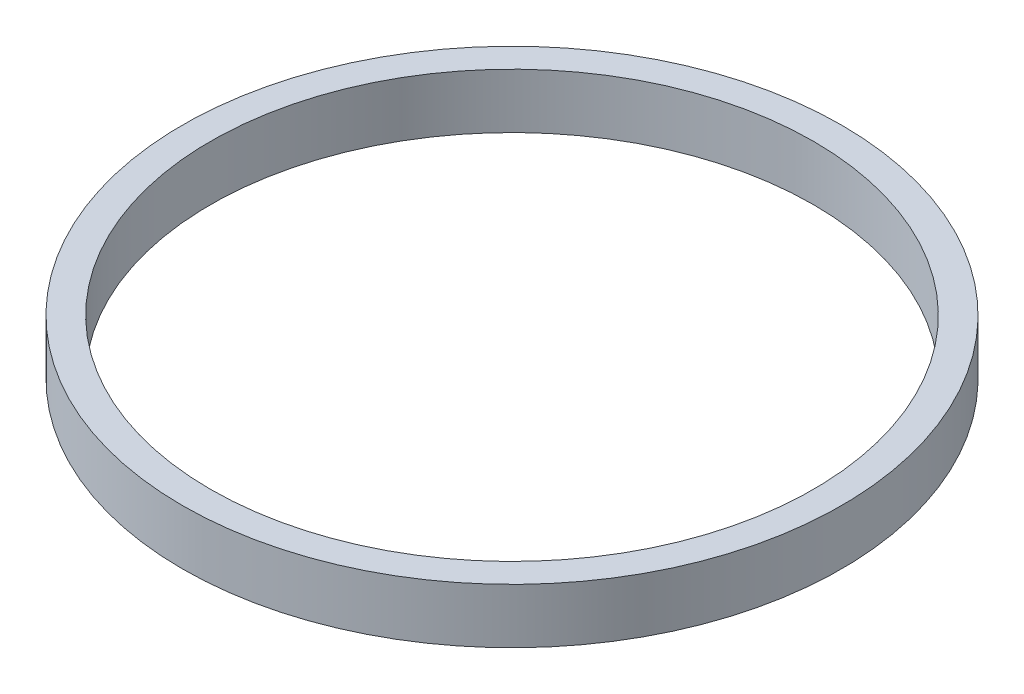
ISO-10303-21;
HEADER;
FILE_DESCRIPTION(('STEP AP214'),'2;1');
FILE_NAME('part.step','',(''),(''),'','','');
FILE_SCHEMA(('AUTOMOTIVE_DESIGN { 1 0 10303 214 1 1 1 1 }'));
ENDSEC;
DATA;
#1=APPLICATION_CONTEXT('core data for automotive mechanical design processes');
#2=APPLICATION_PROTOCOL_DEFINITION('international standard','automotive_design',2000,#1);
#3=PRODUCT_CONTEXT('',#1,'mechanical');
#4=PRODUCT('Part','Part','',(#3));
#5=PRODUCT_RELATED_PRODUCT_CATEGORY('part','',(#4));
#6=PRODUCT_DEFINITION_FORMATION('','',#4);
#7=PRODUCT_DEFINITION_CONTEXT('part definition',#1,'design');
#8=PRODUCT_DEFINITION('design','',#6,#7);
#9=PRODUCT_DEFINITION_SHAPE('','',#8);
#10=(LENGTH_UNIT() NAMED_UNIT(*) SI_UNIT(.MILLI.,.METRE.));
#11=(NAMED_UNIT(*) PLANE_ANGLE_UNIT() SI_UNIT($,.RADIAN.));
#12=(NAMED_UNIT(*) SI_UNIT($,.STERADIAN.) SOLID_ANGLE_UNIT());
#13=UNCERTAINTY_MEASURE_WITH_UNIT(LENGTH_MEASURE(1.E-05),#10,'distance_accuracy_value','');
#14=(GEOMETRIC_REPRESENTATION_CONTEXT(3) GLOBAL_UNCERTAINTY_ASSIGNED_CONTEXT((#13)) GLOBAL_UNIT_ASSIGNED_CONTEXT((#10,
#11,#12)) REPRESENTATION_CONTEXT('',''));
#15=CARTESIAN_POINT('',(0.,0.,0.));
#16=DIRECTION('',(0.,0.,1.));
#17=DIRECTION('',(1.,0.,0.));
#18=AXIS2_PLACEMENT_3D('',#15,#16,#17);
#19=CARTESIAN_POINT('',(0.,12.7,0.));
#20=DIRECTION('',(0.,1.,0.));
#21=DIRECTION('',(0.,0.,1.));
#22=AXIS2_PLACEMENT_3D('',#19,#20,#21);
#23=PLANE('',#22);
#24=CARTESIAN_POINT('',(0.,12.7,0.));
#25=DIRECTION('',(0.,1.,0.));
#26=DIRECTION('',(0.,0.,1.));
#27=AXIS2_PLACEMENT_3D('',#24,#25,#26);
#28=CIRCLE('',#27,76.25);
#29=CARTESIAN_POINT('',(0.,12.7,76.25));
#30=VERTEX_POINT('',#29);
#31=EDGE_CURVE('E10',#30,#30,#28,.T.);
#32=ORIENTED_EDGE('',*,*,#31,.T.);
#33=EDGE_LOOP('',(#32));
#34=FACE_BOUND('',#33,.T.);
#35=CARTESIAN_POINT('',(0.,12.7,0.));
#36=DIRECTION('',(0.,1.,0.));
#37=DIRECTION('',(0.,0.,1.));
#38=AXIS2_PLACEMENT_3D('',#35,#36,#37);
#39=CIRCLE('',#38,69.75);
#40=CARTESIAN_POINT('',(0.,12.7,69.75));
#41=VERTEX_POINT('',#40);
#42=EDGE_CURVE('E54',#41,#41,#39,.T.);
#43=ORIENTED_EDGE('',*,*,#42,.F.);
#44=EDGE_LOOP('',(#43));
#45=FACE_BOUND('',#44,.T.);
#46=ADVANCED_FACE('F41',(#34,#45),#23,.T.);
#47=CARTESIAN_POINT('',(0.,0.,0.));
#48=DIRECTION('',(0.,1.,0.));
#49=DIRECTION('',(0.,0.,1.));
#50=AXIS2_PLACEMENT_3D('',#47,#48,#49);
#51=PLANE('',#50);
#52=CARTESIAN_POINT('',(0.,0.,0.));
#53=DIRECTION('',(0.,1.,0.));
#54=DIRECTION('',(0.,0.,1.));
#55=AXIS2_PLACEMENT_3D('',#52,#53,#54);
#56=CIRCLE('',#55,76.25);
#57=CARTESIAN_POINT('',(0.,0.,76.25));
#58=VERTEX_POINT('',#57);
#59=EDGE_CURVE('E45',#58,#58,#56,.T.);
#60=ORIENTED_EDGE('',*,*,#59,.F.);
#61=EDGE_LOOP('',(#60));
#62=FACE_BOUND('',#61,.T.);
#63=CARTESIAN_POINT('',(0.,0.,0.));
#64=DIRECTION('',(0.,1.,0.));
#65=DIRECTION('',(0.,0.,1.));
#66=AXIS2_PLACEMENT_3D('',#63,#64,#65);
#67=CIRCLE('',#66,69.75);
#68=CARTESIAN_POINT('',(0.,0.,69.75));
#69=VERTEX_POINT('',#68);
#70=EDGE_CURVE('E56',#69,#69,#67,.T.);
#71=ORIENTED_EDGE('',*,*,#70,.T.);
#72=EDGE_LOOP('',(#71));
#73=FACE_BOUND('',#72,.T.);
#74=ADVANCED_FACE('F68',(#62,#73),#51,.F.);
#75=CARTESIAN_POINT('',(0.,12.7,0.));
#76=DIRECTION('',(0.,-1.,0.));
#77=DIRECTION('',(0.,0.,-1.));
#78=AXIS2_PLACEMENT_3D('',#75,#76,#77);
#79=CYLINDRICAL_SURFACE('',#78,76.25);
#80=ORIENTED_EDGE('',*,*,#31,.F.);
#81=EDGE_LOOP('',(#80));
#82=FACE_BOUND('',#81,.T.);
#83=ORIENTED_EDGE('',*,*,#59,.T.);
#84=EDGE_LOOP('',(#83));
#85=FACE_BOUND('',#84,.T.);
#86=ADVANCED_FACE('F43',(#82,#85),#79,.T.);
#87=CARTESIAN_POINT('',(0.,12.7,0.));
#88=DIRECTION('',(0.,-1.,0.));
#89=DIRECTION('',(0.,0.,-1.));
#90=AXIS2_PLACEMENT_3D('',#87,#88,#89);
#91=CYLINDRICAL_SURFACE('',#90,69.75);
#92=ORIENTED_EDGE('',*,*,#42,.T.);
#93=EDGE_LOOP('',(#92));
#94=FACE_BOUND('',#93,.T.);
#95=ORIENTED_EDGE('',*,*,#70,.F.);
#96=EDGE_LOOP('',(#95));
#97=FACE_BOUND('',#96,.T.);
#98=ADVANCED_FACE('F64',(#94,#97),#91,.F.);
#99=CLOSED_SHELL('',(#46,#74,#86,#98));
#100=MANIFOLD_SOLID_BREP('B2',#99);
#101=ADVANCED_BREP_SHAPE_REPRESENTATION('',(#18,#100),#14);
#102=SHAPE_DEFINITION_REPRESENTATION(#9,#101);
ENDSEC;
END-ISO-10303-21;
